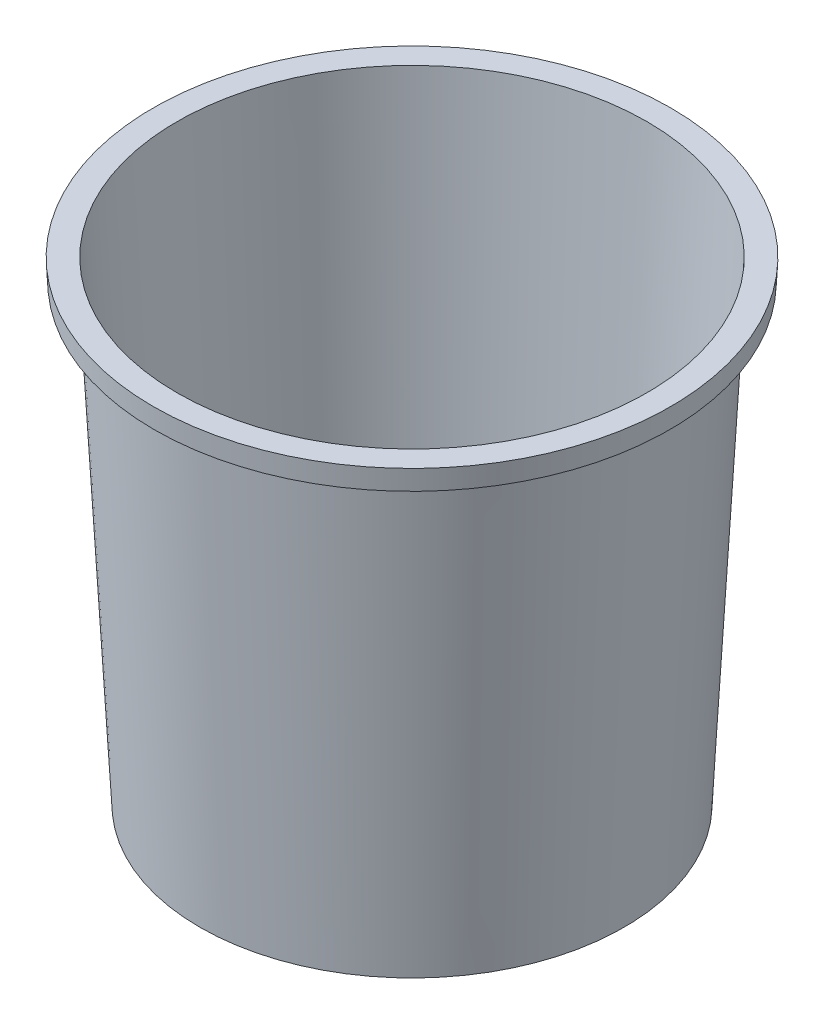
ISO-10303-21;
HEADER;
FILE_DESCRIPTION(('STEP AP214'),'2;1');
FILE_NAME('part.step','',(''),(''),'','','');
FILE_SCHEMA(('AUTOMOTIVE_DESIGN { 1 0 10303 214 1 1 1 1 }'));
ENDSEC;
DATA;
#1=APPLICATION_CONTEXT('core data for automotive mechanical design processes');
#2=APPLICATION_PROTOCOL_DEFINITION('international standard','automotive_design',2000,#1);
#3=PRODUCT_CONTEXT('',#1,'mechanical');
#4=PRODUCT('Part','Part','',(#3));
#5=PRODUCT_RELATED_PRODUCT_CATEGORY('part','',(#4));
#6=PRODUCT_DEFINITION_FORMATION('','',#4);
#7=PRODUCT_DEFINITION_CONTEXT('part definition',#1,'design');
#8=PRODUCT_DEFINITION('design','',#6,#7);
#9=PRODUCT_DEFINITION_SHAPE('','',#8);
#10=(LENGTH_UNIT() NAMED_UNIT(*) SI_UNIT(.MILLI.,.METRE.));
#11=(NAMED_UNIT(*) PLANE_ANGLE_UNIT() SI_UNIT($,.RADIAN.));
#12=(NAMED_UNIT(*) SI_UNIT($,.STERADIAN.) SOLID_ANGLE_UNIT());
#13=UNCERTAINTY_MEASURE_WITH_UNIT(LENGTH_MEASURE(1.E-05),#10,'distance_accuracy_value','');
#14=(GEOMETRIC_REPRESENTATION_CONTEXT(3) GLOBAL_UNCERTAINTY_ASSIGNED_CONTEXT((#13)) GLOBAL_UNIT_ASSIGNED_CONTEXT((#10,
#11,#12)) REPRESENTATION_CONTEXT('',''));
#15=CARTESIAN_POINT('',(0.,0.,0.));
#16=DIRECTION('',(0.,0.,1.));
#17=DIRECTION('',(1.,0.,0.));
#18=AXIS2_PLACEMENT_3D('',#15,#16,#17);
#19=CARTESIAN_POINT('',(0.,230.,0.));
#20=DIRECTION('',(0.,1.,0.));
#21=DIRECTION('',(0.,0.,1.));
#22=AXIS2_PLACEMENT_3D('',#19,#20,#21);
#23=PLANE('',#22);
#24=CARTESIAN_POINT('',(0.,230.,0.));
#25=DIRECTION('',(0.,1.,0.));
#26=DIRECTION('',(0.,0.,1.));
#27=AXIS2_PLACEMENT_3D('',#24,#25,#26);
#28=CIRCLE('',#27,113.952416889102);
#29=CARTESIAN_POINT('',(0.,230.,113.952416889102));
#30=VERTEX_POINT('',#29);
#31=EDGE_CURVE('E56',#30,#30,#28,.T.);
#32=ORIENTED_EDGE('',*,*,#31,.F.);
#33=EDGE_LOOP('',(#32));
#34=FACE_BOUND('',#33,.T.);
#35=CARTESIAN_POINT('',(0.,230.,0.));
#36=DIRECTION('',(0.,1.,0.));
#37=DIRECTION('',(0.,0.,1.));
#38=AXIS2_PLACEMENT_3D('',#35,#36,#37);
#39=CIRCLE('',#38,125.47786702793);
#40=CARTESIAN_POINT('',(0.,230.,125.47786702793));
#41=VERTEX_POINT('',#40);
#42=EDGE_CURVE('E67',#41,#41,#39,.T.);
#43=ORIENTED_EDGE('',*,*,#42,.T.);
#44=EDGE_LOOP('',(#43));
#45=FACE_BOUND('',#44,.T.);
#46=ADVANCED_FACE('F43',(#34,#45),#23,.T.);
#47=CARTESIAN_POINT('',(0.,0.0523359562429439,0.));
#48=DIRECTION('',(0.,1.,0.));
#49=DIRECTION('',(0.,0.,1.));
#50=AXIS2_PLACEMENT_3D('',#47,#48,#49);
#51=CONICAL_SURFACE('',#50,101.901370465245,0.05235987755983);
#52=ORIENTED_EDGE('',*,*,#31,.T.);
#53=EDGE_LOOP('',(#52));
#54=FACE_BOUND('',#53,.T.);
#55=CARTESIAN_POINT('',(0.,1.,0.));
#56=DIRECTION('',(0.,1.,0.));
#57=DIRECTION('',(0.,0.,1.));
#58=AXIS2_PLACEMENT_3D('',#55,#56,#57);
#59=CIRCLE('',#58,101.951035433285);
#60=CARTESIAN_POINT('',(0.,1.,101.951035433285));
#61=VERTEX_POINT('',#60);
#62=EDGE_CURVE('E61',#61,#61,#59,.T.);
#63=ORIENTED_EDGE('',*,*,#62,.F.);
#64=EDGE_LOOP('',(#63));
#65=FACE_BOUND('',#64,.T.);
#66=ADVANCED_FACE('F100',(#54,#65),#51,.F.);
#67=CARTESIAN_POINT('',(0.,1.,0.));
#68=DIRECTION('',(0.,1.,0.));
#69=DIRECTION('',(0.,0.,1.));
#70=AXIS2_PLACEMENT_3D('',#67,#68,#69);
#71=PLANE('',#70);
#72=ORIENTED_EDGE('',*,*,#62,.T.);
#73=EDGE_LOOP('',(#72));
#74=FACE_BOUND('',#73,.T.);
#75=ADVANCED_FACE('F108',(#74),#71,.T.);
#76=CARTESIAN_POINT('',(0.,220.,0.));
#77=DIRECTION('',(0.,1.,0.));
#78=DIRECTION('',(0.,0.,1.));
#79=AXIS2_PLACEMENT_3D('',#76,#77,#78);
#80=CONICAL_SURFACE('',#79,124.9537892351,0.0523598775598309);
#81=ORIENTED_EDGE('',*,*,#42,.F.);
#82=EDGE_LOOP('',(#81));
#83=FACE_BOUND('',#82,.T.);
#84=CARTESIAN_POINT('',(0.,220.,0.));
#85=DIRECTION('',(0.,1.,0.));
#86=DIRECTION('',(0.,0.,1.));
#87=AXIS2_PLACEMENT_3D('',#84,#85,#86);
#88=CIRCLE('',#87,124.9537892351);
#89=CARTESIAN_POINT('',(0.,220.,124.9537892351));
#90=VERTEX_POINT('',#89);
#91=EDGE_CURVE('E71',#90,#90,#88,.T.);
#92=ORIENTED_EDGE('',*,*,#91,.T.);
#93=EDGE_LOOP('',(#92));
#94=FACE_BOUND('',#93,.T.);
#95=ADVANCED_FACE('F114',(#83,#94),#80,.T.);
#96=CARTESIAN_POINT('',(124.9537892351,220.,0.));
#97=DIRECTION('',(0.,1.,0.));
#98=DIRECTION('',(0.,0.,1.));
#99=AXIS2_PLACEMENT_3D('',#96,#97,#98);
#100=PLANE('',#99);
#101=ORIENTED_EDGE('',*,*,#91,.F.);
#102=EDGE_LOOP('',(#101));
#103=FACE_BOUND('',#102,.T.);
#104=CARTESIAN_POINT('',(0.,220.,0.));
#105=DIRECTION('',(0.,1.,0.));
#106=DIRECTION('',(0.,0.,1.));
#107=AXIS2_PLACEMENT_3D('',#104,#105,#106);
#108=CIRCLE('',#107,122.849117322614);
#109=CARTESIAN_POINT('',(0.,220.,122.849117322614));
#110=VERTEX_POINT('',#109);
#111=EDGE_CURVE('E75',#110,#110,#108,.T.);
#112=ORIENTED_EDGE('',*,*,#111,.T.);
#113=EDGE_LOOP('',(#112));
#114=FACE_BOUND('',#113,.T.);
#115=ADVANCED_FACE('F96',(#103,#114),#100,.F.);
#116=CARTESIAN_POINT('',(0.,228.002740930491,0.));
#117=DIRECTION('',(0.,1.,0.));
#118=DIRECTION('',(0.,0.,1.));
#119=AXIS2_PLACEMENT_3D('',#116,#117,#118);
#120=CONICAL_SURFACE('',#119,123.268523202958,0.0523598775598307);
#121=ORIENTED_EDGE('',*,*,#111,.F.);
#122=EDGE_LOOP('',(#121));
#123=FACE_BOUND('',#122,.T.);
#124=CARTESIAN_POINT('',(0.,228.002740930491,0.));
#125=DIRECTION('',(0.,1.,0.));
#126=DIRECTION('',(0.,0.,1.));
#127=AXIS2_PLACEMENT_3D('',#124,#125,#126);
#128=CIRCLE('',#127,123.268523202958);
#129=CARTESIAN_POINT('',(0.,228.002740930491,123.268523202958));
#130=VERTEX_POINT('',#129);
#131=EDGE_CURVE('E79',#130,#130,#128,.T.);
#132=ORIENTED_EDGE('',*,*,#131,.T.);
#133=EDGE_LOOP('',(#132));
#134=FACE_BOUND('',#133,.T.);
#135=ADVANCED_FACE('F84',(#123,#134),#120,.F.);
#136=CARTESIAN_POINT('',(123.268523202958,228.002740930491,0.));
#137=DIRECTION('',(0.,1.,0.));
#138=DIRECTION('',(0.,0.,1.));
#139=AXIS2_PLACEMENT_3D('',#136,#137,#138);
#140=PLANE('',#139);
#141=ORIENTED_EDGE('',*,*,#131,.F.);
#142=EDGE_LOOP('',(#141));
#143=FACE_BOUND('',#142,.T.);
#144=CARTESIAN_POINT('',(0.,228.002740930491,0.));
#145=DIRECTION('',(0.,1.,0.));
#146=DIRECTION('',(0.,0.,1.));
#147=AXIS2_PLACEMENT_3D('',#144,#145,#146);
#148=CIRCLE('',#147,114.849117322614);
#149=CARTESIAN_POINT('',(0.,228.002740930491,114.849117322614));
#150=VERTEX_POINT('',#149);
#151=EDGE_CURVE('E10',#150,#150,#148,.T.);
#152=ORIENTED_EDGE('',*,*,#151,.T.);
#153=EDGE_LOOP('',(#152));
#154=FACE_BOUND('',#153,.T.);
#155=ADVANCED_FACE('F86',(#143,#154),#140,.F.);
#156=CARTESIAN_POINT('',(0.,0.,0.));
#157=DIRECTION('',(0.,1.,0.));
#158=DIRECTION('',(0.,0.,1.));
#159=AXIS2_PLACEMENT_3D('',#156,#157,#158);
#160=PLANE('',#159);
#161=CARTESIAN_POINT('',(0.,0.,0.));
#162=DIRECTION('',(0.,1.,0.));
#163=DIRECTION('',(0.,0.,1.));
#164=AXIS2_PLACEMENT_3D('',#161,#162,#163);
#165=CIRCLE('',#164,102.9);
#166=CARTESIAN_POINT('',(0.,0.,102.9));
#167=VERTEX_POINT('',#166);
#168=EDGE_CURVE('E51',#167,#167,#165,.T.);
#169=ORIENTED_EDGE('',*,*,#168,.F.);
#170=EDGE_LOOP('',(#169));
#171=FACE_BOUND('',#170,.T.);
#172=ADVANCED_FACE('F88',(#171),#160,.F.);
#173=CARTESIAN_POINT('',(0.,0.,0.));
#174=DIRECTION('',(0.,1.,0.));
#175=DIRECTION('',(0.,0.,1.));
#176=AXIS2_PLACEMENT_3D('',#173,#174,#175);
#177=CONICAL_SURFACE('',#176,102.9,0.05235987755983);
#178=ORIENTED_EDGE('',*,*,#168,.T.);
#179=EDGE_LOOP('',(#178));
#180=FACE_BOUND('',#179,.T.);
#181=ORIENTED_EDGE('',*,*,#151,.F.);
#182=EDGE_LOOP('',(#181));
#183=FACE_BOUND('',#182,.T.);
#184=ADVANCED_FACE('F45',(#180,#183),#177,.T.);
#185=CLOSED_SHELL('',(#46,#66,#75,#95,#115,#135,#155,#172,#184));
#186=MANIFOLD_SOLID_BREP('B2',#185);
#187=ADVANCED_BREP_SHAPE_REPRESENTATION('',(#18,#186),#14);
#188=SHAPE_DEFINITION_REPRESENTATION(#9,#187);
ENDSEC;
END-ISO-10303-21;
